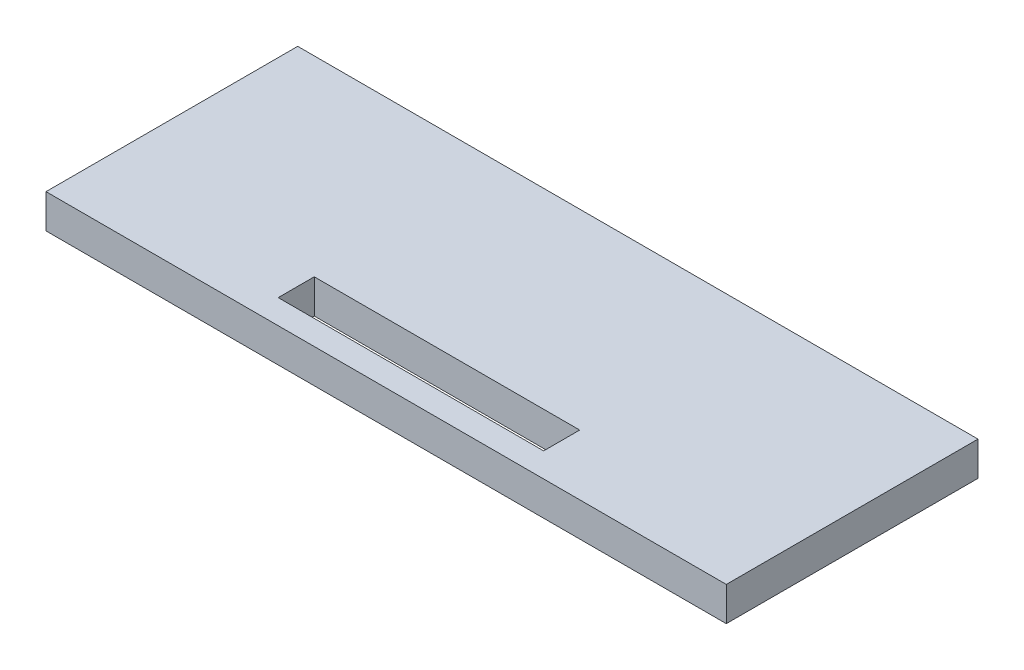
ISO-10303-21;
HEADER;
FILE_DESCRIPTION(('STEP AP214'),'2;1');
FILE_NAME('part.step','',(''),(''),'','','');
FILE_SCHEMA(('AUTOMOTIVE_DESIGN { 1 0 10303 214 1 1 1 1 }'));
ENDSEC;
DATA;
#1=APPLICATION_CONTEXT('core data for automotive mechanical design processes');
#2=APPLICATION_PROTOCOL_DEFINITION('international standard','automotive_design',2000,#1);
#3=PRODUCT_CONTEXT('',#1,'mechanical');
#4=PRODUCT('Part','Part','',(#3));
#5=PRODUCT_RELATED_PRODUCT_CATEGORY('part','',(#4));
#6=PRODUCT_DEFINITION_FORMATION('','',#4);
#7=PRODUCT_DEFINITION_CONTEXT('part definition',#1,'design');
#8=PRODUCT_DEFINITION('design','',#6,#7);
#9=PRODUCT_DEFINITION_SHAPE('','',#8);
#10=(LENGTH_UNIT() NAMED_UNIT(*) SI_UNIT(.MILLI.,.METRE.));
#11=(NAMED_UNIT(*) PLANE_ANGLE_UNIT() SI_UNIT($,.RADIAN.));
#12=(NAMED_UNIT(*) SI_UNIT($,.STERADIAN.) SOLID_ANGLE_UNIT());
#13=UNCERTAINTY_MEASURE_WITH_UNIT(LENGTH_MEASURE(1.E-05),#10,'distance_accuracy_value','');
#14=(GEOMETRIC_REPRESENTATION_CONTEXT(3) GLOBAL_UNCERTAINTY_ASSIGNED_CONTEXT((#13)) GLOBAL_UNIT_ASSIGNED_CONTEXT((#10,
#11,#12)) REPRESENTATION_CONTEXT('',''));
#15=CARTESIAN_POINT('',(0.,0.,0.));
#16=DIRECTION('',(0.,0.,1.));
#17=DIRECTION('',(1.,0.,0.));
#18=AXIS2_PLACEMENT_3D('',#15,#16,#17);
#19=CARTESIAN_POINT('',(50.0000000283191,86.6025403661439,137.079968026066));
#20=DIRECTION('',(0.,1.,0.));
#21=DIRECTION('',(0.,0.,1.));
#22=AXIS2_PLACEMENT_3D('',#19,#20,#21);
#23=PLANE('',#22);
#24=DIRECTION('',(0.,0.,-1.));
#25=VECTOR('',#24,1.);
#26=CARTESIAN_POINT('',(50.0000000283191,86.6025403661439,137.079968026066));
#27=LINE('',#26,#25);
#28=CARTESIAN_POINT('',(50.0000000283191,86.6025403661439,37.));
#29=VERTEX_POINT('',#28);
#30=CARTESIAN_POINT('',(50.0000000283191,86.6025403661439,0.));
#31=VERTEX_POINT('',#30);
#32=EDGE_CURVE('E149',#29,#31,#27,.T.);
#33=ORIENTED_EDGE('',*,*,#32,.F.);
#34=DIRECTION('',(-1.,0.,0.));
#35=VECTOR('',#34,1.);
#36=CARTESIAN_POINT('',(50.0000000283191,86.6025403661439,37.));
#37=LINE('',#36,#35);
#38=CARTESIAN_POINT('',(-49.9999999716809,86.6025403661439,37.));
#39=VERTEX_POINT('',#38);
#40=EDGE_CURVE('E135',#29,#39,#37,.T.);
#41=ORIENTED_EDGE('',*,*,#40,.T.);
#42=DIRECTION('',(0.,0.,-1.));
#43=VECTOR('',#42,1.);
#44=CARTESIAN_POINT('',(-49.9999999716809,86.6025403661439,137.079968026066));
#45=LINE('',#44,#43);
#46=CARTESIAN_POINT('',(-49.9999999716809,86.6025403661439,0.));
#47=VERTEX_POINT('',#46);
#48=EDGE_CURVE('E147',#39,#47,#45,.T.);
#49=ORIENTED_EDGE('',*,*,#48,.T.);
#50=DIRECTION('',(1.,0.,0.));
#51=VECTOR('',#50,1.);
#52=CARTESIAN_POINT('',(50.0000000283191,86.6025403661439,0.));
#53=LINE('',#52,#51);
#54=EDGE_CURVE('E131',#47,#31,#53,.T.);
#55=ORIENTED_EDGE('',*,*,#54,.T.);
#56=EDGE_LOOP('',(#33,#41,#49,#55));
#57=FACE_BOUND('',#56,.T.);
#58=DIRECTION('',(-1.,0.,0.));
#59=VECTOR('',#58,1.);
#60=CARTESIAN_POINT('',(50.000000028319,86.6025403661439,33.4244095305818));
#61=LINE('',#60,#59);
#62=CARTESIAN_POINT('',(19.5750314235064,86.6025403661439,33.4244095305818));
#63=VERTEX_POINT('',#62);
#64=CARTESIAN_POINT('',(-19.4430899634055,86.6025403661439,33.4244095305818));
#65=VERTEX_POINT('',#64);
#66=EDGE_CURVE('E114',#63,#65,#61,.T.);
#67=ORIENTED_EDGE('',*,*,#66,.F.);
#68=DIRECTION('',(0.,0.,1.));
#69=VECTOR('',#68,1.);
#70=CARTESIAN_POINT('',(19.5750314235064,86.6025403661439,137.079968026066));
#71=LINE('',#70,#69);
#72=CARTESIAN_POINT('',(19.5750314235064,86.6025403661439,28.1244095305818));
#73=VERTEX_POINT('',#72);
#74=EDGE_CURVE('E112',#73,#63,#71,.T.);
#75=ORIENTED_EDGE('',*,*,#74,.F.);
#76=DIRECTION('',(1.,0.,0.));
#77=VECTOR('',#76,1.);
#78=CARTESIAN_POINT('',(50.000000028319,86.6025403661439,28.1244095305818));
#79=LINE('',#78,#77);
#80=CARTESIAN_POINT('',(-19.4430899634055,86.6025403661439,28.1244095305818));
#81=VERTEX_POINT('',#80);
#82=EDGE_CURVE('E99',#81,#73,#79,.T.);
#83=ORIENTED_EDGE('',*,*,#82,.F.);
#84=DIRECTION('',(0.,0.,1.));
#85=VECTOR('',#84,1.);
#86=CARTESIAN_POINT('',(-19.4430899634054,86.6025403661439,137.079968026066));
#87=LINE('',#86,#85);
#88=EDGE_CURVE('E94',#81,#65,#87,.T.);
#89=ORIENTED_EDGE('',*,*,#88,.T.);
#90=EDGE_LOOP('',(#67,#75,#83,#89));
#91=FACE_BOUND('',#90,.T.);
#92=ADVANCED_FACE('F33',(#57,#91),#23,.F.);
#93=CARTESIAN_POINT('',(0.,91.6025403784456,0.));
#94=DIRECTION('',(0.,1.,0.));
#95=DIRECTION('',(0.,0.,1.));
#96=AXIS2_PLACEMENT_3D('',#93,#94,#95);
#97=PLANE('',#96);
#98=DIRECTION('',(-1.,0.,0.));
#99=VECTOR('',#98,1.);
#100=CARTESIAN_POINT('',(50.0000000283191,91.6025403784456,0.));
#101=LINE('',#100,#99);
#102=CARTESIAN_POINT('',(50.0000000283191,91.6025403784456,0.));
#103=VERTEX_POINT('',#102);
#104=CARTESIAN_POINT('',(-49.9999999716809,91.6025403784456,0.));
#105=VERTEX_POINT('',#104);
#106=EDGE_CURVE('E119',#103,#105,#101,.T.);
#107=ORIENTED_EDGE('',*,*,#106,.T.);
#108=DIRECTION('',(0.,0.,1.));
#109=VECTOR('',#108,1.);
#110=CARTESIAN_POINT('',(-49.9999999716809,91.6025403784456,0.));
#111=LINE('',#110,#109);
#112=CARTESIAN_POINT('',(-49.9999999716809,91.6025403784456,37.));
#113=VERTEX_POINT('',#112);
#114=EDGE_CURVE('E122',#105,#113,#111,.T.);
#115=ORIENTED_EDGE('',*,*,#114,.T.);
#116=DIRECTION('',(1.,0.,0.));
#117=VECTOR('',#116,1.);
#118=CARTESIAN_POINT('',(-49.9999999716809,91.6025403784456,37.));
#119=LINE('',#118,#117);
#120=CARTESIAN_POINT('',(50.0000000283191,91.6025403784456,37.));
#121=VERTEX_POINT('',#120);
#122=EDGE_CURVE('E125',#113,#121,#119,.T.);
#123=ORIENTED_EDGE('',*,*,#122,.T.);
#124=DIRECTION('',(0.,0.,-1.));
#125=VECTOR('',#124,1.);
#126=CARTESIAN_POINT('',(50.0000000283191,91.6025403784456,37.));
#127=LINE('',#126,#125);
#128=EDGE_CURVE('E128',#121,#103,#127,.T.);
#129=ORIENTED_EDGE('',*,*,#128,.T.);
#130=EDGE_LOOP('',(#107,#115,#123,#129));
#131=FACE_BOUND('',#130,.T.);
#132=DIRECTION('',(0.,0.,1.));
#133=VECTOR('',#132,1.);
#134=CARTESIAN_POINT('',(19.5750314235064,91.6025403784456,0.));
#135=LINE('',#134,#133);
#136=CARTESIAN_POINT('',(19.5750314235064,91.6025403784456,28.1244095305818));
#137=VERTEX_POINT('',#136);
#138=CARTESIAN_POINT('',(19.5750314235064,91.6025403784456,33.4244095305818));
#139=VERTEX_POINT('',#138);
#140=EDGE_CURVE('E40',#137,#139,#135,.T.);
#141=ORIENTED_EDGE('',*,*,#140,.T.);
#142=DIRECTION('',(-1.,0.,0.));
#143=VECTOR('',#142,1.);
#144=CARTESIAN_POINT('',(0.,91.6025403784456,33.4244095305818));
#145=LINE('',#144,#143);
#146=CARTESIAN_POINT('',(-19.4430899634055,91.6025403784456,33.4244095305818));
#147=VERTEX_POINT('',#146);
#148=EDGE_CURVE('E12',#139,#147,#145,.T.);
#149=ORIENTED_EDGE('',*,*,#148,.T.);
#150=DIRECTION('',(0.,0.,1.));
#151=VECTOR('',#150,1.);
#152=CARTESIAN_POINT('',(-19.4430899634055,91.6025403784456,0.));
#153=LINE('',#152,#151);
#154=CARTESIAN_POINT('',(-19.4430899634055,91.6025403784456,28.1244095305818));
#155=VERTEX_POINT('',#154);
#156=EDGE_CURVE('E139',#155,#147,#153,.T.);
#157=ORIENTED_EDGE('',*,*,#156,.F.);
#158=DIRECTION('',(1.,0.,0.));
#159=VECTOR('',#158,1.);
#160=CARTESIAN_POINT('',(0.,91.6025403784456,28.1244095305818));
#161=LINE('',#160,#159);
#162=EDGE_CURVE('E107',#155,#137,#161,.T.);
#163=ORIENTED_EDGE('',*,*,#162,.T.);
#164=EDGE_LOOP('',(#141,#149,#157,#163));
#165=FACE_BOUND('',#164,.T.);
#166=ADVANCED_FACE('F155',(#131,#165),#97,.T.);
#167=CARTESIAN_POINT('',(0.,0.,0.));
#168=DIRECTION('',(0.,0.,-1.));
#169=DIRECTION('',(-1.,0.,0.));
#170=AXIS2_PLACEMENT_3D('',#167,#168,#169);
#171=PLANE('',#170);
#172=ORIENTED_EDGE('',*,*,#54,.F.);
#173=DIRECTION('',(0.,-1.,0.));
#174=VECTOR('',#173,1.);
#175=CARTESIAN_POINT('',(-49.9999999716809,86.6025403661439,0.));
#176=LINE('',#175,#174);
#177=EDGE_CURVE('E144',#105,#47,#176,.T.);
#178=ORIENTED_EDGE('',*,*,#177,.F.);
#179=ORIENTED_EDGE('',*,*,#106,.F.);
#180=DIRECTION('',(0.,1.,0.));
#181=VECTOR('',#180,1.);
#182=CARTESIAN_POINT('',(50.0000000283191,90.6025403784456,0.));
#183=LINE('',#182,#181);
#184=EDGE_CURVE('E142',#31,#103,#183,.T.);
#185=ORIENTED_EDGE('',*,*,#184,.F.);
#186=EDGE_LOOP('',(#172,#178,#179,#185));
#187=FACE_BOUND('',#186,.T.);
#188=ADVANCED_FACE('F181',(#187),#171,.T.);
#189=CARTESIAN_POINT('',(-49.9999999716809,86.6025403661439,137.079968026066));
#190=DIRECTION('',(1.,0.,0.));
#191=DIRECTION('',(0.,0.,-1.));
#192=AXIS2_PLACEMENT_3D('',#189,#190,#191);
#193=PLANE('',#192);
#194=ORIENTED_EDGE('',*,*,#48,.F.);
#195=DIRECTION('',(0.,1.,0.));
#196=VECTOR('',#195,1.);
#197=CARTESIAN_POINT('',(-49.9999999716809,86.6025403661439,37.));
#198=LINE('',#197,#196);
#199=EDGE_CURVE('E136',#39,#113,#198,.T.);
#200=ORIENTED_EDGE('',*,*,#199,.T.);
#201=ORIENTED_EDGE('',*,*,#114,.F.);
#202=ORIENTED_EDGE('',*,*,#177,.T.);
#203=EDGE_LOOP('',(#194,#200,#201,#202));
#204=FACE_BOUND('',#203,.T.);
#205=ADVANCED_FACE('F193',(#204),#193,.F.);
#206=CARTESIAN_POINT('',(50.0000000283191,90.6025403784456,137.079968026066));
#207=DIRECTION('',(-1.,0.,0.));
#208=DIRECTION('',(0.,0.,1.));
#209=AXIS2_PLACEMENT_3D('',#206,#207,#208);
#210=PLANE('',#209);
#211=ORIENTED_EDGE('',*,*,#184,.T.);
#212=ORIENTED_EDGE('',*,*,#128,.F.);
#213=DIRECTION('',(0.,-1.,0.));
#214=VECTOR('',#213,1.);
#215=CARTESIAN_POINT('',(50.0000000283191,90.6025403784456,37.));
#216=LINE('',#215,#214);
#217=EDGE_CURVE('E132',#121,#29,#216,.T.);
#218=ORIENTED_EDGE('',*,*,#217,.T.);
#219=ORIENTED_EDGE('',*,*,#32,.T.);
#220=EDGE_LOOP('',(#211,#212,#218,#219));
#221=FACE_BOUND('',#220,.T.);
#222=ADVANCED_FACE('F172',(#221),#210,.F.);
#223=CARTESIAN_POINT('',(-47.4999999162171,-82.2724134038411,37.));
#224=DIRECTION('',(0.,0.,-1.));
#225=DIRECTION('',(-3.37068095657145E-10,1.,0.));
#226=AXIS2_PLACEMENT_3D('',#223,#224,#225);
#227=PLANE('',#226);
#228=ORIENTED_EDGE('',*,*,#217,.F.);
#229=ORIENTED_EDGE('',*,*,#122,.F.);
#230=ORIENTED_EDGE('',*,*,#199,.F.);
#231=ORIENTED_EDGE('',*,*,#40,.F.);
#232=EDGE_LOOP('',(#228,#229,#230,#231));
#233=FACE_BOUND('',#232,.T.);
#234=ADVANCED_FACE('F165',(#233),#227,.F.);
#235=CARTESIAN_POINT('',(0.,91.6025523784456,33.4244095305818));
#236=DIRECTION('',(0.,0.,-1.));
#237=DIRECTION('',(-1.,0.,0.));
#238=AXIS2_PLACEMENT_3D('',#235,#236,#237);
#239=PLANE('',#238);
#240=ORIENTED_EDGE('',*,*,#66,.T.);
#241=DIRECTION('',(0.,-1.,0.));
#242=VECTOR('',#241,1.);
#243=CARTESIAN_POINT('',(-19.4430899634055,91.6025523784456,33.4244095305818));
#244=LINE('',#243,#242);
#245=EDGE_CURVE('E47',#147,#65,#244,.T.);
#246=ORIENTED_EDGE('',*,*,#245,.F.);
#247=ORIENTED_EDGE('',*,*,#148,.F.);
#248=DIRECTION('',(0.,-1.,0.));
#249=VECTOR('',#248,1.);
#250=CARTESIAN_POINT('',(19.5750314235064,91.6025523784456,33.4244095305818));
#251=LINE('',#250,#249);
#252=EDGE_CURVE('E100',#139,#63,#251,.T.);
#253=ORIENTED_EDGE('',*,*,#252,.T.);
#254=EDGE_LOOP('',(#240,#246,#247,#253));
#255=FACE_BOUND('',#254,.T.);
#256=ADVANCED_FACE('F163',(#255),#239,.T.);
#257=CARTESIAN_POINT('',(19.5750314235064,91.6025523784456,0.));
#258=DIRECTION('',(-1.,0.,0.));
#259=DIRECTION('',(0.,0.,1.));
#260=AXIS2_PLACEMENT_3D('',#257,#258,#259);
#261=PLANE('',#260);
#262=ORIENTED_EDGE('',*,*,#74,.T.);
#263=ORIENTED_EDGE('',*,*,#252,.F.);
#264=ORIENTED_EDGE('',*,*,#140,.F.);
#265=DIRECTION('',(0.,-1.,0.));
#266=VECTOR('',#265,1.);
#267=CARTESIAN_POINT('',(19.5750314235064,91.6025523784456,28.1244095305818));
#268=LINE('',#267,#266);
#269=EDGE_CURVE('E109',#137,#73,#268,.T.);
#270=ORIENTED_EDGE('',*,*,#269,.T.);
#271=EDGE_LOOP('',(#262,#263,#264,#270));
#272=FACE_BOUND('',#271,.T.);
#273=ADVANCED_FACE('F158',(#272),#261,.T.);
#274=CARTESIAN_POINT('',(0.,91.6025523784456,28.1244095305818));
#275=DIRECTION('',(0.,0.,1.));
#276=DIRECTION('',(1.,0.,0.));
#277=AXIS2_PLACEMENT_3D('',#274,#275,#276);
#278=PLANE('',#277);
#279=ORIENTED_EDGE('',*,*,#82,.T.);
#280=ORIENTED_EDGE('',*,*,#269,.F.);
#281=ORIENTED_EDGE('',*,*,#162,.F.);
#282=DIRECTION('',(0.,-1.,0.));
#283=VECTOR('',#282,1.);
#284=CARTESIAN_POINT('',(-19.4430899634055,91.6025523784456,28.1244095305818));
#285=LINE('',#284,#283);
#286=EDGE_CURVE('E52',#155,#81,#285,.T.);
#287=ORIENTED_EDGE('',*,*,#286,.T.);
#288=EDGE_LOOP('',(#279,#280,#281,#287));
#289=FACE_BOUND('',#288,.T.);
#290=ADVANCED_FACE('F103',(#289),#278,.T.);
#291=CARTESIAN_POINT('',(-19.4430899634055,91.6025523784456,0.));
#292=DIRECTION('',(-1.,0.,0.));
#293=DIRECTION('',(0.,0.,1.));
#294=AXIS2_PLACEMENT_3D('',#291,#292,#293);
#295=PLANE('',#294);
#296=ORIENTED_EDGE('',*,*,#286,.F.);
#297=ORIENTED_EDGE('',*,*,#156,.T.);
#298=ORIENTED_EDGE('',*,*,#245,.T.);
#299=ORIENTED_EDGE('',*,*,#88,.F.);
#300=EDGE_LOOP('',(#296,#297,#298,#299));
#301=FACE_BOUND('',#300,.T.);
#302=ADVANCED_FACE('F95',(#301),#295,.F.);
#303=CLOSED_SHELL('',(#92,#166,#188,#205,#222,#234,#256,#273,#290,#302));
#304=MANIFOLD_SOLID_BREP('B2',#303);
#305=ADVANCED_BREP_SHAPE_REPRESENTATION('',(#18,#304),#14);
#306=SHAPE_DEFINITION_REPRESENTATION(#9,#305);
ENDSEC;
END-ISO-10303-21;
